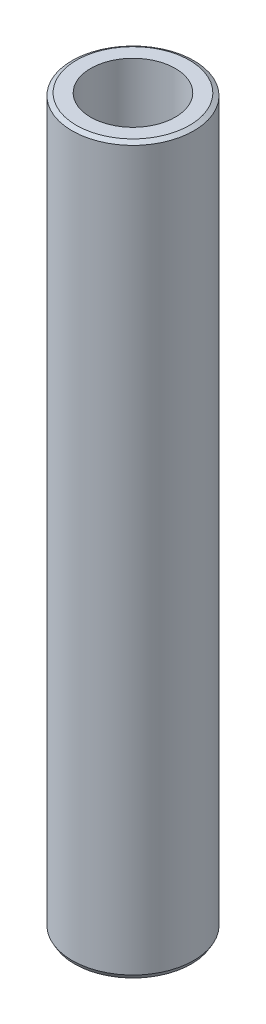
ISO-10303-21;
HEADER;
FILE_DESCRIPTION(('STEP AP214'),'2;1');
FILE_NAME('part.step','',(''),(''),'','','');
FILE_SCHEMA(('AUTOMOTIVE_DESIGN { 1 0 10303 214 1 1 1 1 }'));
ENDSEC;
DATA;
#1=APPLICATION_CONTEXT('core data for automotive mechanical design processes');
#2=APPLICATION_PROTOCOL_DEFINITION('international standard','automotive_design',2000,#1);
#3=PRODUCT_CONTEXT('',#1,'mechanical');
#4=PRODUCT('Part','Part','',(#3));
#5=PRODUCT_RELATED_PRODUCT_CATEGORY('part','',(#4));
#6=PRODUCT_DEFINITION_FORMATION('','',#4);
#7=PRODUCT_DEFINITION_CONTEXT('part definition',#1,'design');
#8=PRODUCT_DEFINITION('design','',#6,#7);
#9=PRODUCT_DEFINITION_SHAPE('','',#8);
#10=(LENGTH_UNIT() NAMED_UNIT(*) SI_UNIT(.MILLI.,.METRE.));
#11=(NAMED_UNIT(*) PLANE_ANGLE_UNIT() SI_UNIT($,.RADIAN.));
#12=(NAMED_UNIT(*) SI_UNIT($,.STERADIAN.) SOLID_ANGLE_UNIT());
#13=UNCERTAINTY_MEASURE_WITH_UNIT(LENGTH_MEASURE(1.E-05),#10,'distance_accuracy_value','');
#14=(GEOMETRIC_REPRESENTATION_CONTEXT(3) GLOBAL_UNCERTAINTY_ASSIGNED_CONTEXT((#13)) GLOBAL_UNIT_ASSIGNED_CONTEXT((#10,
#11,#12)) REPRESENTATION_CONTEXT('',''));
#15=CARTESIAN_POINT('',(0.,0.,0.));
#16=DIRECTION('',(0.,0.,1.));
#17=DIRECTION('',(1.,0.,0.));
#18=AXIS2_PLACEMENT_3D('',#15,#16,#17);
#19=CARTESIAN_POINT('',(0.,506.458577231732,0.));
#20=DIRECTION('',(0.,-1.,0.));
#21=DIRECTION('',(0.,0.,-1.));
#22=AXIS2_PLACEMENT_3D('',#19,#20,#21);
#23=CYLINDRICAL_SURFACE('',#22,42.5);
#24=CARTESIAN_POINT('',(0.,504.702231572454,0.));
#25=DIRECTION('',(0.,1.,0.));
#26=DIRECTION('',(0.,0.,1.));
#27=AXIS2_PLACEMENT_3D('',#24,#25,#26);
#28=CIRCLE('',#27,42.5);
#29=CARTESIAN_POINT('',(0.,504.702231572454,42.5));
#30=VERTEX_POINT('',#29);
#31=EDGE_CURVE('E50',#30,#30,#28,.F.);
#32=ORIENTED_EDGE('',*,*,#31,.T.);
#33=EDGE_LOOP('',(#32));
#34=FACE_BOUND('',#33,.T.);
#35=CARTESIAN_POINT('',(0.,3.0420799175217,0.));
#36=DIRECTION('',(0.,1.,0.));
#37=DIRECTION('',(0.,0.,1.));
#38=AXIS2_PLACEMENT_3D('',#35,#36,#37);
#39=CIRCLE('',#38,42.5);
#40=CARTESIAN_POINT('',(0.,3.0420799175217,42.5));
#41=VERTEX_POINT('',#40);
#42=EDGE_CURVE('E51',#41,#41,#39,.T.);
#43=ORIENTED_EDGE('',*,*,#42,.T.);
#44=EDGE_LOOP('',(#43));
#45=FACE_BOUND('',#44,.T.);
#46=ADVANCED_FACE('F39',(#34,#45),#23,.T.);
#47=CARTESIAN_POINT('',(0.,506.458577231732,0.));
#48=DIRECTION('',(0.,1.,0.));
#49=DIRECTION('',(0.,0.,1.));
#50=AXIS2_PLACEMENT_3D('',#47,#48,#49);
#51=PLANE('',#50);
#52=CARTESIAN_POINT('',(0.,506.458577231732,0.));
#53=DIRECTION('',(0.,1.,0.));
#54=DIRECTION('',(0.,0.,1.));
#55=AXIS2_PLACEMENT_3D('',#52,#53,#54);
#56=CIRCLE('',#55,39.4579200824784);
#57=CARTESIAN_POINT('',(0.,506.458577231732,39.4579200824784));
#58=VERTEX_POINT('',#57);
#59=EDGE_CURVE('E54',#58,#58,#56,.T.);
#60=ORIENTED_EDGE('',*,*,#59,.T.);
#61=EDGE_LOOP('',(#60));
#62=FACE_BOUND('',#61,.T.);
#63=CARTESIAN_POINT('',(0.,506.458577231732,0.));
#64=DIRECTION('',(0.,1.,0.));
#65=DIRECTION('',(0.,0.,1.));
#66=AXIS2_PLACEMENT_3D('',#63,#64,#65);
#67=CIRCLE('',#66,29.5402919063328);
#68=CARTESIAN_POINT('',(0.,506.458577231732,29.5402919063328));
#69=VERTEX_POINT('',#68);
#70=EDGE_CURVE('E58',#69,#69,#67,.T.);
#71=ORIENTED_EDGE('',*,*,#70,.F.);
#72=EDGE_LOOP('',(#71));
#73=FACE_BOUND('',#72,.T.);
#74=ADVANCED_FACE('F69',(#62,#73),#51,.T.);
#75=CARTESIAN_POINT('',(0.,0.,0.));
#76=DIRECTION('',(0.,1.,0.));
#77=DIRECTION('',(0.,0.,1.));
#78=AXIS2_PLACEMENT_3D('',#75,#76,#77);
#79=PLANE('',#78);
#80=CARTESIAN_POINT('',(0.,0.,0.));
#81=DIRECTION('',(0.,1.,0.));
#82=DIRECTION('',(0.,0.,1.));
#83=AXIS2_PLACEMENT_3D('',#80,#81,#82);
#84=CIRCLE('',#83,40.7436543407224);
#85=CARTESIAN_POINT('',(0.,0.,40.7436543407224));
#86=VERTEX_POINT('',#85);
#87=EDGE_CURVE('E10',#86,#86,#84,.F.);
#88=ORIENTED_EDGE('',*,*,#87,.T.);
#89=EDGE_LOOP('',(#88));
#90=FACE_BOUND('',#89,.T.);
#91=CARTESIAN_POINT('',(0.,0.,0.));
#92=DIRECTION('',(0.,1.,0.));
#93=DIRECTION('',(0.,0.,1.));
#94=AXIS2_PLACEMENT_3D('',#91,#92,#93);
#95=CIRCLE('',#94,29.5402919063328);
#96=CARTESIAN_POINT('',(0.,0.,29.5402919063328));
#97=VERTEX_POINT('',#96);
#98=EDGE_CURVE('E63',#97,#97,#95,.T.);
#99=ORIENTED_EDGE('',*,*,#98,.T.);
#100=EDGE_LOOP('',(#99));
#101=FACE_BOUND('',#100,.T.);
#102=ADVANCED_FACE('F75',(#90,#101),#79,.F.);
#103=CARTESIAN_POINT('',(0.,506.458577231732,0.));
#104=DIRECTION('',(0.,-1.,0.));
#105=DIRECTION('',(0.,0.,-1.));
#106=AXIS2_PLACEMENT_3D('',#103,#104,#105);
#107=CYLINDRICAL_SURFACE('',#106,29.5402919063328);
#108=ORIENTED_EDGE('',*,*,#70,.T.);
#109=EDGE_LOOP('',(#108));
#110=FACE_BOUND('',#109,.T.);
#111=ORIENTED_EDGE('',*,*,#98,.F.);
#112=EDGE_LOOP('',(#111));
#113=FACE_BOUND('',#112,.T.);
#114=ADVANCED_FACE('F70',(#110,#113),#107,.F.);
#115=CARTESIAN_POINT('',(0.,506.458577231732,0.));
#116=DIRECTION('',(0.,-1.,0.));
#117=DIRECTION('',(0.,0.,-1.));
#118=AXIS2_PLACEMENT_3D('',#115,#116,#117);
#119=CONICAL_SURFACE('',#118,39.4579200824784,1.04719755119658);
#120=ORIENTED_EDGE('',*,*,#31,.F.);
#121=EDGE_LOOP('',(#120));
#122=FACE_BOUND('',#121,.T.);
#123=ORIENTED_EDGE('',*,*,#59,.F.);
#124=EDGE_LOOP('',(#123));
#125=FACE_BOUND('',#124,.T.);
#126=ADVANCED_FACE('F81',(#122,#125),#119,.T.);
#127=CARTESIAN_POINT('',(0.,3.0420799175217,0.));
#128=DIRECTION('',(0.,1.,0.));
#129=DIRECTION('',(0.,0.,1.));
#130=AXIS2_PLACEMENT_3D('',#127,#128,#129);
#131=CONICAL_SURFACE('',#130,42.5,0.523598775598314);
#132=ORIENTED_EDGE('',*,*,#87,.F.);
#133=EDGE_LOOP('',(#132));
#134=FACE_BOUND('',#133,.T.);
#135=ORIENTED_EDGE('',*,*,#42,.F.);
#136=EDGE_LOOP('',(#135));
#137=FACE_BOUND('',#136,.T.);
#138=ADVANCED_FACE('F45',(#134,#137),#131,.T.);
#139=CLOSED_SHELL('',(#46,#74,#102,#114,#126,#138));
#140=MANIFOLD_SOLID_BREP('B2',#139);
#141=ADVANCED_BREP_SHAPE_REPRESENTATION('',(#18,#140),#14);
#142=SHAPE_DEFINITION_REPRESENTATION(#9,#141);
ENDSEC;
END-ISO-10303-21;
